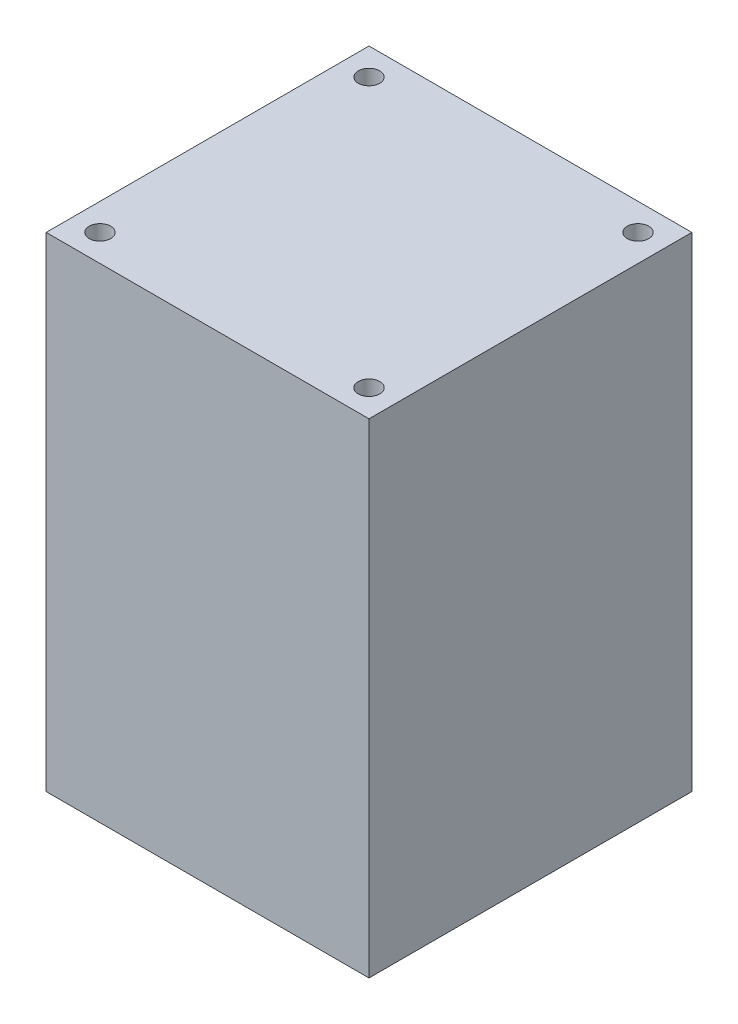
ISO-10303-21;
HEADER;
FILE_DESCRIPTION(('STEP AP214'),'2;1');
FILE_NAME('part.step','',(''),(''),'','','');
FILE_SCHEMA(('AUTOMOTIVE_DESIGN { 1 0 10303 214 1 1 1 1 }'));
ENDSEC;
DATA;
#1=APPLICATION_CONTEXT('core data for automotive mechanical design processes');
#2=APPLICATION_PROTOCOL_DEFINITION('international standard','automotive_design',2000,#1);
#3=PRODUCT_CONTEXT('',#1,'mechanical');
#4=PRODUCT('Part','Part','',(#3));
#5=PRODUCT_RELATED_PRODUCT_CATEGORY('part','',(#4));
#6=PRODUCT_DEFINITION_FORMATION('','',#4);
#7=PRODUCT_DEFINITION_CONTEXT('part definition',#1,'design');
#8=PRODUCT_DEFINITION('design','',#6,#7);
#9=PRODUCT_DEFINITION_SHAPE('','',#8);
#10=(LENGTH_UNIT() NAMED_UNIT(*) SI_UNIT(.MILLI.,.METRE.));
#11=(NAMED_UNIT(*) PLANE_ANGLE_UNIT() SI_UNIT($,.RADIAN.));
#12=(NAMED_UNIT(*) SI_UNIT($,.STERADIAN.) SOLID_ANGLE_UNIT());
#13=UNCERTAINTY_MEASURE_WITH_UNIT(LENGTH_MEASURE(1.E-05),#10,'distance_accuracy_value','');
#14=(GEOMETRIC_REPRESENTATION_CONTEXT(3) GLOBAL_UNCERTAINTY_ASSIGNED_CONTEXT((#13)) GLOBAL_UNIT_ASSIGNED_CONTEXT((#10,
#11,#12)) REPRESENTATION_CONTEXT('',''));
#15=CARTESIAN_POINT('',(0.,0.,0.));
#16=DIRECTION('',(0.,0.,1.));
#17=DIRECTION('',(1.,0.,0.));
#18=AXIS2_PLACEMENT_3D('',#15,#16,#17);
#19=CARTESIAN_POINT('',(30.,90.,-30.));
#20=DIRECTION('',(-1.,0.,0.));
#21=DIRECTION('',(0.,0.,1.));
#22=AXIS2_PLACEMENT_3D('',#19,#20,#21);
#23=PLANE('',#22);
#24=DIRECTION('',(0.,0.,-1.));
#25=VECTOR('',#24,1.);
#26=CARTESIAN_POINT('',(30.,0.,-30.));
#27=LINE('',#26,#25);
#28=CARTESIAN_POINT('',(30.,0.,30.));
#29=VERTEX_POINT('',#28);
#30=CARTESIAN_POINT('',(30.,0.,-30.));
#31=VERTEX_POINT('',#30);
#32=EDGE_CURVE('E100',#29,#31,#27,.T.);
#33=ORIENTED_EDGE('',*,*,#32,.T.);
#34=DIRECTION('',(0.,-1.,0.));
#35=VECTOR('',#34,1.);
#36=CARTESIAN_POINT('',(30.,90.,-30.));
#37=LINE('',#36,#35);
#38=CARTESIAN_POINT('',(30.,90.,-30.));
#39=VERTEX_POINT('',#38);
#40=EDGE_CURVE('E11',#39,#31,#37,.T.);
#41=ORIENTED_EDGE('',*,*,#40,.F.);
#42=DIRECTION('',(0.,0.,-1.));
#43=VECTOR('',#42,1.);
#44=CARTESIAN_POINT('',(30.,90.,-30.));
#45=LINE('',#44,#43);
#46=CARTESIAN_POINT('',(30.,90.,30.));
#47=VERTEX_POINT('',#46);
#48=EDGE_CURVE('E88',#47,#39,#45,.T.);
#49=ORIENTED_EDGE('',*,*,#48,.F.);
#50=DIRECTION('',(0.,-1.,0.));
#51=VECTOR('',#50,1.);
#52=CARTESIAN_POINT('',(30.,90.,30.));
#53=LINE('',#52,#51);
#54=EDGE_CURVE('E96',#47,#29,#53,.T.);
#55=ORIENTED_EDGE('',*,*,#54,.T.);
#56=EDGE_LOOP('',(#33,#41,#49,#55));
#57=FACE_BOUND('',#56,.T.);
#58=ADVANCED_FACE('F37',(#57),#23,.F.);
#59=CARTESIAN_POINT('',(-30.,90.,-30.));
#60=DIRECTION('',(0.,0.,1.));
#61=DIRECTION('',(1.,0.,0.));
#62=AXIS2_PLACEMENT_3D('',#59,#60,#61);
#63=PLANE('',#62);
#64=DIRECTION('',(-1.,0.,0.));
#65=VECTOR('',#64,1.);
#66=CARTESIAN_POINT('',(-30.,0.,-30.));
#67=LINE('',#66,#65);
#68=CARTESIAN_POINT('',(-30.,0.,-30.));
#69=VERTEX_POINT('',#68);
#70=EDGE_CURVE('E92',#31,#69,#67,.T.);
#71=ORIENTED_EDGE('',*,*,#70,.T.);
#72=DIRECTION('',(0.,-1.,0.));
#73=VECTOR('',#72,1.);
#74=CARTESIAN_POINT('',(-30.,90.,-30.));
#75=LINE('',#74,#73);
#76=CARTESIAN_POINT('',(-30.,90.,-30.));
#77=VERTEX_POINT('',#76);
#78=EDGE_CURVE('E45',#77,#69,#75,.T.);
#79=ORIENTED_EDGE('',*,*,#78,.F.);
#80=DIRECTION('',(-1.,0.,0.));
#81=VECTOR('',#80,1.);
#82=CARTESIAN_POINT('',(-30.,90.,-30.));
#83=LINE('',#82,#81);
#84=EDGE_CURVE('E83',#39,#77,#83,.T.);
#85=ORIENTED_EDGE('',*,*,#84,.F.);
#86=ORIENTED_EDGE('',*,*,#40,.T.);
#87=EDGE_LOOP('',(#71,#79,#85,#86));
#88=FACE_BOUND('',#87,.T.);
#89=ADVANCED_FACE('F91',(#88),#63,.F.);
#90=CARTESIAN_POINT('',(-30.,90.,-30.));
#91=DIRECTION('',(1.,0.,0.));
#92=DIRECTION('',(0.,0.,-1.));
#93=AXIS2_PLACEMENT_3D('',#90,#91,#92);
#94=PLANE('',#93);
#95=DIRECTION('',(0.,0.,1.));
#96=VECTOR('',#95,1.);
#97=CARTESIAN_POINT('',(-30.,0.,-30.));
#98=LINE('',#97,#96);
#99=CARTESIAN_POINT('',(-30.,0.,30.));
#100=VERTEX_POINT('',#99);
#101=EDGE_CURVE('E70',#69,#100,#98,.T.);
#102=ORIENTED_EDGE('',*,*,#101,.T.);
#103=DIRECTION('',(0.,-1.,0.));
#104=VECTOR('',#103,1.);
#105=CARTESIAN_POINT('',(-30.,90.,30.));
#106=LINE('',#105,#104);
#107=CARTESIAN_POINT('',(-30.,90.,30.));
#108=VERTEX_POINT('',#107);
#109=EDGE_CURVE('E93',#108,#100,#106,.T.);
#110=ORIENTED_EDGE('',*,*,#109,.F.);
#111=DIRECTION('',(0.,0.,1.));
#112=VECTOR('',#111,1.);
#113=CARTESIAN_POINT('',(-30.,90.,-30.));
#114=LINE('',#113,#112);
#115=EDGE_CURVE('E86',#77,#108,#114,.T.);
#116=ORIENTED_EDGE('',*,*,#115,.F.);
#117=ORIENTED_EDGE('',*,*,#78,.T.);
#118=EDGE_LOOP('',(#102,#110,#116,#117));
#119=FACE_BOUND('',#118,.T.);
#120=ADVANCED_FACE('F94',(#119),#94,.F.);
#121=CARTESIAN_POINT('',(-30.,90.,30.));
#122=DIRECTION('',(0.,0.,-1.));
#123=DIRECTION('',(-1.,0.,0.));
#124=AXIS2_PLACEMENT_3D('',#121,#122,#123);
#125=PLANE('',#124);
#126=DIRECTION('',(1.,0.,0.));
#127=VECTOR('',#126,1.);
#128=CARTESIAN_POINT('',(-30.,0.,30.));
#129=LINE('',#128,#127);
#130=EDGE_CURVE('E76',#100,#29,#129,.T.);
#131=ORIENTED_EDGE('',*,*,#130,.T.);
#132=ORIENTED_EDGE('',*,*,#54,.F.);
#133=DIRECTION('',(1.,0.,0.));
#134=VECTOR('',#133,1.);
#135=CARTESIAN_POINT('',(-30.,90.,30.));
#136=LINE('',#135,#134);
#137=EDGE_CURVE('E53',#108,#47,#136,.T.);
#138=ORIENTED_EDGE('',*,*,#137,.F.);
#139=ORIENTED_EDGE('',*,*,#109,.T.);
#140=EDGE_LOOP('',(#131,#132,#138,#139));
#141=FACE_BOUND('',#140,.T.);
#142=ADVANCED_FACE('F108',(#141),#125,.F.);
#143=CARTESIAN_POINT('',(0.,90.,0.));
#144=DIRECTION('',(0.,1.,0.));
#145=DIRECTION('',(0.,0.,1.));
#146=AXIS2_PLACEMENT_3D('',#143,#144,#145);
#147=PLANE('',#146);
#148=CARTESIAN_POINT('',(-25.,90.,25.));
#149=DIRECTION('',(0.,-1.,0.));
#150=DIRECTION('',(0.,0.,-1.));
#151=AXIS2_PLACEMENT_3D('',#148,#149,#150);
#152=CIRCLE('',#151,2.);
#153=CARTESIAN_POINT('',(-25.,90.,23.));
#154=VERTEX_POINT('',#153);
#155=EDGE_CURVE('E132',#154,#154,#152,.T.);
#156=ORIENTED_EDGE('',*,*,#155,.T.);
#157=EDGE_LOOP('',(#156));
#158=FACE_BOUND('',#157,.T.);
#159=CARTESIAN_POINT('',(25.,90.,25.));
#160=DIRECTION('',(0.,1.,0.));
#161=DIRECTION('',(0.,0.,-1.));
#162=AXIS2_PLACEMENT_3D('',#159,#160,#161);
#163=CIRCLE('',#162,2.);
#164=CARTESIAN_POINT('',(25.,90.,23.));
#165=VERTEX_POINT('',#164);
#166=EDGE_CURVE('E126',#165,#165,#163,.T.);
#167=ORIENTED_EDGE('',*,*,#166,.F.);
#168=EDGE_LOOP('',(#167));
#169=FACE_BOUND('',#168,.T.);
#170=CARTESIAN_POINT('',(25.,90.,-25.));
#171=DIRECTION('',(0.,-1.,0.));
#172=DIRECTION('',(0.,0.,1.));
#173=AXIS2_PLACEMENT_3D('',#170,#171,#172);
#174=CIRCLE('',#173,2.);
#175=CARTESIAN_POINT('',(25.,90.,-23.));
#176=VERTEX_POINT('',#175);
#177=EDGE_CURVE('E120',#176,#176,#174,.T.);
#178=ORIENTED_EDGE('',*,*,#177,.T.);
#179=EDGE_LOOP('',(#178));
#180=FACE_BOUND('',#179,.T.);
#181=CARTESIAN_POINT('',(-25.,90.,-25.));
#182=DIRECTION('',(0.,1.,0.));
#183=DIRECTION('',(0.,0.,1.));
#184=AXIS2_PLACEMENT_3D('',#181,#182,#183);
#185=CIRCLE('',#184,2.);
#186=CARTESIAN_POINT('',(-25.,90.,-23.));
#187=VERTEX_POINT('',#186);
#188=EDGE_CURVE('E114',#187,#187,#185,.T.);
#189=ORIENTED_EDGE('',*,*,#188,.F.);
#190=EDGE_LOOP('',(#189));
#191=FACE_BOUND('',#190,.T.);
#192=ORIENTED_EDGE('',*,*,#48,.T.);
#193=ORIENTED_EDGE('',*,*,#84,.T.);
#194=ORIENTED_EDGE('',*,*,#115,.T.);
#195=ORIENTED_EDGE('',*,*,#137,.T.);
#196=EDGE_LOOP('',(#192,#193,#194,#195));
#197=FACE_BOUND('',#196,.T.);
#198=ADVANCED_FACE('F84',(#158,#169,#180,#191,#197),#147,.T.);
#199=CARTESIAN_POINT('',(0.,0.,0.));
#200=DIRECTION('',(0.,1.,0.));
#201=DIRECTION('',(0.,0.,1.));
#202=AXIS2_PLACEMENT_3D('',#199,#200,#201);
#203=PLANE('',#202);
#204=ORIENTED_EDGE('',*,*,#32,.F.);
#205=ORIENTED_EDGE('',*,*,#130,.F.);
#206=ORIENTED_EDGE('',*,*,#101,.F.);
#207=ORIENTED_EDGE('',*,*,#70,.F.);
#208=EDGE_LOOP('',(#204,#205,#206,#207));
#209=FACE_BOUND('',#208,.T.);
#210=ADVANCED_FACE('F111',(#209),#203,.F.);
#211=CARTESIAN_POINT('',(-25.,80.,-25.));
#212=DIRECTION('',(0.,1.,0.));
#213=DIRECTION('',(0.,0.,1.));
#214=AXIS2_PLACEMENT_3D('',#211,#212,#213);
#215=CYLINDRICAL_SURFACE('',#214,2.);
#216=CARTESIAN_POINT('',(-25.,80.,-25.));
#217=DIRECTION('',(0.,1.,0.));
#218=DIRECTION('',(0.,0.,1.));
#219=AXIS2_PLACEMENT_3D('',#216,#217,#218);
#220=CIRCLE('',#219,2.);
#221=CARTESIAN_POINT('',(-25.,80.,-23.));
#222=VERTEX_POINT('',#221);
#223=EDGE_CURVE('E103',#222,#222,#220,.T.);
#224=ORIENTED_EDGE('',*,*,#223,.F.);
#225=EDGE_LOOP('',(#224));
#226=FACE_BOUND('',#225,.T.);
#227=ORIENTED_EDGE('',*,*,#188,.T.);
#228=EDGE_LOOP('',(#227));
#229=FACE_BOUND('',#228,.T.);
#230=ADVANCED_FACE('F162',(#226,#229),#215,.F.);
#231=CARTESIAN_POINT('',(-25.,80.,-25.));
#232=DIRECTION('',(0.,1.,0.));
#233=DIRECTION('',(0.,0.,1.));
#234=AXIS2_PLACEMENT_3D('',#231,#232,#233);
#235=PLANE('',#234);
#236=ORIENTED_EDGE('',*,*,#223,.T.);
#237=EDGE_LOOP('',(#236));
#238=FACE_BOUND('',#237,.T.);
#239=ADVANCED_FACE('F168',(#238),#235,.T.);
#240=CARTESIAN_POINT('',(25.,80.,-25.));
#241=DIRECTION('',(0.,1.,0.));
#242=DIRECTION('',(0.,0.,1.));
#243=AXIS2_PLACEMENT_3D('',#240,#241,#242);
#244=CYLINDRICAL_SURFACE('',#243,2.);
#245=CARTESIAN_POINT('',(25.,80.,-25.));
#246=DIRECTION('',(0.,-1.,0.));
#247=DIRECTION('',(0.,0.,1.));
#248=AXIS2_PLACEMENT_3D('',#245,#246,#247);
#249=CIRCLE('',#248,2.);
#250=CARTESIAN_POINT('',(25.,80.,-23.));
#251=VERTEX_POINT('',#250);
#252=EDGE_CURVE('E117',#251,#251,#249,.T.);
#253=ORIENTED_EDGE('',*,*,#252,.T.);
#254=EDGE_LOOP('',(#253));
#255=FACE_BOUND('',#254,.T.);
#256=ORIENTED_EDGE('',*,*,#177,.F.);
#257=EDGE_LOOP('',(#256));
#258=FACE_BOUND('',#257,.T.);
#259=ADVANCED_FACE('F172',(#255,#258),#244,.F.);
#260=CARTESIAN_POINT('',(25.,80.,-25.));
#261=DIRECTION('',(0.,1.,0.));
#262=DIRECTION('',(0.,0.,1.));
#263=AXIS2_PLACEMENT_3D('',#260,#261,#262);
#264=PLANE('',#263);
#265=ORIENTED_EDGE('',*,*,#252,.F.);
#266=EDGE_LOOP('',(#265));
#267=FACE_BOUND('',#266,.T.);
#268=ADVANCED_FACE('F176',(#267),#264,.T.);
#269=CARTESIAN_POINT('',(25.,80.,25.));
#270=DIRECTION('',(0.,1.,0.));
#271=DIRECTION('',(0.,0.,1.));
#272=AXIS2_PLACEMENT_3D('',#269,#270,#271);
#273=CYLINDRICAL_SURFACE('',#272,2.);
#274=CARTESIAN_POINT('',(25.,80.,25.));
#275=DIRECTION('',(0.,1.,0.));
#276=DIRECTION('',(0.,0.,-1.));
#277=AXIS2_PLACEMENT_3D('',#274,#275,#276);
#278=CIRCLE('',#277,2.);
#279=CARTESIAN_POINT('',(25.,80.,23.));
#280=VERTEX_POINT('',#279);
#281=EDGE_CURVE('E123',#280,#280,#278,.T.);
#282=ORIENTED_EDGE('',*,*,#281,.F.);
#283=EDGE_LOOP('',(#282));
#284=FACE_BOUND('',#283,.T.);
#285=ORIENTED_EDGE('',*,*,#166,.T.);
#286=EDGE_LOOP('',(#285));
#287=FACE_BOUND('',#286,.T.);
#288=ADVANCED_FACE('F180',(#284,#287),#273,.F.);
#289=CARTESIAN_POINT('',(25.,80.,25.));
#290=DIRECTION('',(0.,1.,0.));
#291=DIRECTION('',(0.,0.,-1.));
#292=AXIS2_PLACEMENT_3D('',#289,#290,#291);
#293=PLANE('',#292);
#294=ORIENTED_EDGE('',*,*,#281,.T.);
#295=EDGE_LOOP('',(#294));
#296=FACE_BOUND('',#295,.T.);
#297=ADVANCED_FACE('F147',(#296),#293,.T.);
#298=CARTESIAN_POINT('',(-25.,80.,25.));
#299=DIRECTION('',(0.,1.,0.));
#300=DIRECTION('',(0.,0.,1.));
#301=AXIS2_PLACEMENT_3D('',#298,#299,#300);
#302=CYLINDRICAL_SURFACE('',#301,2.);
#303=CARTESIAN_POINT('',(-25.,80.,25.));
#304=DIRECTION('',(0.,-1.,0.));
#305=DIRECTION('',(0.,0.,-1.));
#306=AXIS2_PLACEMENT_3D('',#303,#304,#305);
#307=CIRCLE('',#306,2.);
#308=CARTESIAN_POINT('',(-25.,80.,23.));
#309=VERTEX_POINT('',#308);
#310=EDGE_CURVE('E129',#309,#309,#307,.T.);
#311=ORIENTED_EDGE('',*,*,#310,.T.);
#312=EDGE_LOOP('',(#311));
#313=FACE_BOUND('',#312,.T.);
#314=ORIENTED_EDGE('',*,*,#155,.F.);
#315=EDGE_LOOP('',(#314));
#316=FACE_BOUND('',#315,.T.);
#317=ADVANCED_FACE('F138',(#313,#316),#302,.F.);
#318=CARTESIAN_POINT('',(-25.,80.,25.));
#319=DIRECTION('',(0.,1.,0.));
#320=DIRECTION('',(0.,0.,-1.));
#321=AXIS2_PLACEMENT_3D('',#318,#319,#320);
#322=PLANE('',#321);
#323=ORIENTED_EDGE('',*,*,#310,.F.);
#324=EDGE_LOOP('',(#323));
#325=FACE_BOUND('',#324,.T.);
#326=ADVANCED_FACE('F141',(#325),#322,.T.);
#327=CLOSED_SHELL('',(#58,#89,#120,#142,#198,#210,#230,#239,#259,#268,#288,#297,#317,#326));
#328=MANIFOLD_SOLID_BREP('B2',#327);
#329=ADVANCED_BREP_SHAPE_REPRESENTATION('',(#18,#328),#14);
#330=SHAPE_DEFINITION_REPRESENTATION(#9,#329);
ENDSEC;
END-ISO-10303-21;
